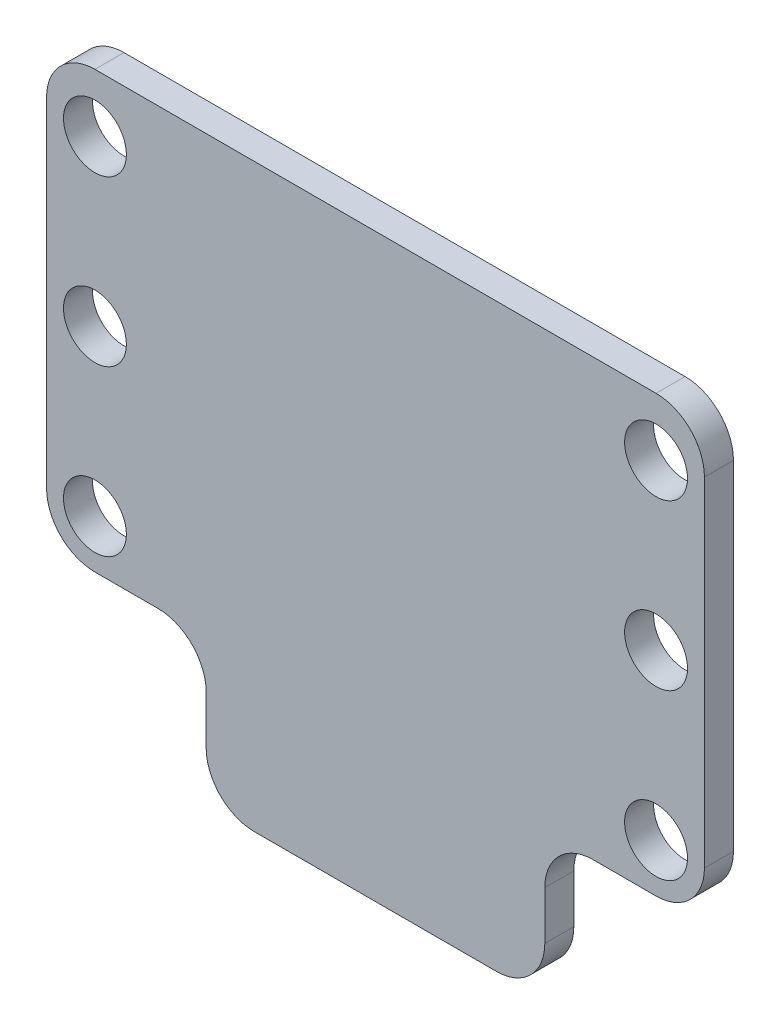
ISO-10303-21;
HEADER;
FILE_DESCRIPTION(('STEP AP214'),'2;1');
FILE_NAME('part.step','',(''),(''),'','','');
FILE_SCHEMA(('AUTOMOTIVE_DESIGN { 1 0 10303 214 1 1 1 1 }'));
ENDSEC;
DATA;
#1=APPLICATION_CONTEXT('core data for automotive mechanical design processes');
#2=APPLICATION_PROTOCOL_DEFINITION('international standard','automotive_design',2000,#1);
#3=PRODUCT_CONTEXT('',#1,'mechanical');
#4=PRODUCT('Part','Part','',(#3));
#5=PRODUCT_RELATED_PRODUCT_CATEGORY('part','',(#4));
#6=PRODUCT_DEFINITION_FORMATION('','',#4);
#7=PRODUCT_DEFINITION_CONTEXT('part definition',#1,'design');
#8=PRODUCT_DEFINITION('design','',#6,#7);
#9=PRODUCT_DEFINITION_SHAPE('','',#8);
#10=(LENGTH_UNIT() NAMED_UNIT(*) SI_UNIT(.MILLI.,.METRE.));
#11=(NAMED_UNIT(*) PLANE_ANGLE_UNIT() SI_UNIT($,.RADIAN.));
#12=(NAMED_UNIT(*) SI_UNIT($,.STERADIAN.) SOLID_ANGLE_UNIT());
#13=UNCERTAINTY_MEASURE_WITH_UNIT(LENGTH_MEASURE(1.E-05),#10,'distance_accuracy_value','');
#14=(GEOMETRIC_REPRESENTATION_CONTEXT(3) GLOBAL_UNCERTAINTY_ASSIGNED_CONTEXT((#13)) GLOBAL_UNIT_ASSIGNED_CONTEXT((#10,
#11,#12)) REPRESENTATION_CONTEXT('',''));
#15=CARTESIAN_POINT('',(0.,0.,0.));
#16=DIRECTION('',(0.,0.,1.));
#17=DIRECTION('',(1.,0.,0.));
#18=AXIS2_PLACEMENT_3D('',#15,#16,#17);
#19=CARTESIAN_POINT('',(0.,0.,3.));
#20=DIRECTION('',(0.,0.,-1.));
#21=DIRECTION('',(-1.,0.,0.));
#22=AXIS2_PLACEMENT_3D('',#19,#20,#21);
#23=PLANE('',#22);
#24=DIRECTION('',(-1.,0.,0.));
#25=VECTOR('',#24,1.);
#26=CARTESIAN_POINT('',(107.208492458902,1.90147341211974,3.));
#27=LINE('',#26,#25);
#28=CARTESIAN_POINT('',(102.208492458902,1.90147341211974,3.));
#29=VERTEX_POINT('',#28);
#30=CARTESIAN_POINT('',(44.2084924589014,1.90147341211974,3.));
#31=VERTEX_POINT('',#30);
#32=EDGE_CURVE('E338',#29,#31,#27,.T.);
#33=ORIENTED_EDGE('',*,*,#32,.T.);
#34=CARTESIAN_POINT('',(44.2084924589014,-3.09852658788026,3.));
#35=DIRECTION('',(0.,0.,-1.));
#36=DIRECTION('',(-1.,0.,0.));
#37=AXIS2_PLACEMENT_3D('',#34,#35,#36);
#38=CIRCLE('',#37,5.);
#39=CARTESIAN_POINT('',(39.2084924589014,-3.09852658788026,3.));
#40=VERTEX_POINT('',#39);
#41=EDGE_CURVE('E246',#31,#40,#38,.F.);
#42=ORIENTED_EDGE('',*,*,#41,.T.);
#43=DIRECTION('',(0.,-1.,0.));
#44=VECTOR('',#43,1.);
#45=CARTESIAN_POINT('',(39.2084924589014,1.90147341211974,3.));
#46=LINE('',#45,#44);
#47=CARTESIAN_POINT('',(39.2084924589014,-38.0985265878802,3.));
#48=VERTEX_POINT('',#47);
#49=EDGE_CURVE('E174',#40,#48,#46,.T.);
#50=ORIENTED_EDGE('',*,*,#49,.T.);
#51=CARTESIAN_POINT('',(44.2084924589014,-38.0985265878803,3.));
#52=DIRECTION('',(0.,0.,-1.));
#53=DIRECTION('',(-1.,0.,0.));
#54=AXIS2_PLACEMENT_3D('',#51,#52,#53);
#55=CIRCLE('',#54,5.);
#56=CARTESIAN_POINT('',(44.2084924589014,-43.0985265878803,3.));
#57=VERTEX_POINT('',#56);
#58=EDGE_CURVE('E243',#48,#57,#55,.F.);
#59=ORIENTED_EDGE('',*,*,#58,.T.);
#60=DIRECTION('',(1.,0.,0.));
#61=VECTOR('',#60,1.);
#62=CARTESIAN_POINT('',(55.7084924589017,-43.0985265878803,3.));
#63=LINE('',#62,#61);
#64=CARTESIAN_POINT('',(50.7084924589017,-43.0985265878803,3.));
#65=VERTEX_POINT('',#64);
#66=EDGE_CURVE('E344',#57,#65,#63,.T.);
#67=ORIENTED_EDGE('',*,*,#66,.T.);
#68=CARTESIAN_POINT('',(50.7084924589017,-48.0985265878803,3.));
#69=DIRECTION('',(0.,0.,-1.));
#70=DIRECTION('',(-1.,0.,0.));
#71=AXIS2_PLACEMENT_3D('',#68,#69,#70);
#72=CIRCLE('',#71,5.);
#73=CARTESIAN_POINT('',(55.7084924589017,-48.0985265878803,3.));
#74=VERTEX_POINT('',#73);
#75=EDGE_CURVE('E293',#65,#74,#72,.T.);
#76=ORIENTED_EDGE('',*,*,#75,.T.);
#77=DIRECTION('',(0.,-1.,0.));
#78=VECTOR('',#77,1.);
#79=CARTESIAN_POINT('',(55.7084924589017,-43.0985265878803,3.));
#80=LINE('',#79,#78);
#81=CARTESIAN_POINT('',(55.7084924589017,-53.0985265878803,3.));
#82=VERTEX_POINT('',#81);
#83=EDGE_CURVE('E348',#74,#82,#80,.T.);
#84=ORIENTED_EDGE('',*,*,#83,.T.);
#85=CARTESIAN_POINT('',(60.7084924589016,-53.0985265878803,3.));
#86=DIRECTION('',(0.,0.,-1.));
#87=DIRECTION('',(-1.,0.,0.));
#88=AXIS2_PLACEMENT_3D('',#85,#86,#87);
#89=CIRCLE('',#88,5.);
#90=CARTESIAN_POINT('',(60.7084924589016,-58.0985265878803,3.));
#91=VERTEX_POINT('',#90);
#92=EDGE_CURVE('E240',#82,#91,#89,.F.);
#93=ORIENTED_EDGE('',*,*,#92,.T.);
#94=DIRECTION('',(1.,0.,0.));
#95=VECTOR('',#94,1.);
#96=CARTESIAN_POINT('',(90.7084924589017,-58.0985265878803,3.));
#97=LINE('',#96,#95);
#98=CARTESIAN_POINT('',(85.7084924589016,-58.0985265878803,3.));
#99=VERTEX_POINT('',#98);
#100=EDGE_CURVE('E312',#91,#99,#97,.T.);
#101=ORIENTED_EDGE('',*,*,#100,.T.);
#102=CARTESIAN_POINT('',(85.7084924589016,-53.0985265878803,3.));
#103=DIRECTION('',(0.,0.,-1.));
#104=DIRECTION('',(-1.,0.,0.));
#105=AXIS2_PLACEMENT_3D('',#102,#103,#104);
#106=CIRCLE('',#105,5.);
#107=CARTESIAN_POINT('',(90.7084924589017,-53.0985265878803,3.));
#108=VERTEX_POINT('',#107);
#109=EDGE_CURVE('E237',#99,#108,#106,.F.);
#110=ORIENTED_EDGE('',*,*,#109,.T.);
#111=DIRECTION('',(0.,1.,0.));
#112=VECTOR('',#111,1.);
#113=CARTESIAN_POINT('',(90.7084924589017,-43.0985265878803,3.));
#114=LINE('',#113,#112);
#115=CARTESIAN_POINT('',(90.7084924589017,-48.0985265878803,3.));
#116=VERTEX_POINT('',#115);
#117=EDGE_CURVE('E309',#108,#116,#114,.T.);
#118=ORIENTED_EDGE('',*,*,#117,.T.);
#119=CARTESIAN_POINT('',(95.7084924589017,-48.0985265878803,3.));
#120=DIRECTION('',(0.,0.,-1.));
#121=DIRECTION('',(-1.,0.,0.));
#122=AXIS2_PLACEMENT_3D('',#119,#120,#121);
#123=CIRCLE('',#122,5.);
#124=CARTESIAN_POINT('',(95.7084924589017,-43.0985265878803,3.));
#125=VERTEX_POINT('',#124);
#126=EDGE_CURVE('E11',#116,#125,#123,.T.);
#127=ORIENTED_EDGE('',*,*,#126,.T.);
#128=DIRECTION('',(1.,0.,0.));
#129=VECTOR('',#128,1.);
#130=CARTESIAN_POINT('',(107.208492458902,-43.0985265878803,3.));
#131=LINE('',#130,#129);
#132=CARTESIAN_POINT('',(102.208492458902,-43.0985265878803,3.));
#133=VERTEX_POINT('',#132);
#134=EDGE_CURVE('E211',#125,#133,#131,.T.);
#135=ORIENTED_EDGE('',*,*,#134,.T.);
#136=CARTESIAN_POINT('',(102.208492458902,-38.0985265878803,3.));
#137=DIRECTION('',(0.,0.,-1.));
#138=DIRECTION('',(-1.,0.,0.));
#139=AXIS2_PLACEMENT_3D('',#136,#137,#138);
#140=CIRCLE('',#139,5.);
#141=CARTESIAN_POINT('',(107.208492458902,-38.0985265878802,3.));
#142=VERTEX_POINT('',#141);
#143=EDGE_CURVE('E234',#133,#142,#140,.F.);
#144=ORIENTED_EDGE('',*,*,#143,.T.);
#145=DIRECTION('',(0.,1.,0.));
#146=VECTOR('',#145,1.);
#147=CARTESIAN_POINT('',(107.208492458902,1.90147341211974,3.));
#148=LINE('',#147,#146);
#149=CARTESIAN_POINT('',(107.208492458902,-3.09852658788026,3.));
#150=VERTEX_POINT('',#149);
#151=EDGE_CURVE('E209',#142,#150,#148,.T.);
#152=ORIENTED_EDGE('',*,*,#151,.T.);
#153=CARTESIAN_POINT('',(102.208492458902,-3.09852658788026,3.));
#154=DIRECTION('',(0.,0.,-1.));
#155=DIRECTION('',(-1.,0.,0.));
#156=AXIS2_PLACEMENT_3D('',#153,#154,#155);
#157=CIRCLE('',#156,5.);
#158=EDGE_CURVE('E231',#150,#29,#157,.F.);
#159=ORIENTED_EDGE('',*,*,#158,.T.);
#160=EDGE_LOOP('',(#33,#42,#50,#59,#67,#76,#84,#93,#101,#110,#118,#127,#135,#144,#152,#159));
#161=FACE_BOUND('',#160,.T.);
#162=CARTESIAN_POINT('',(102.208492458902,-4.09852658788026,3.));
#163=DIRECTION('',(0.,0.,1.));
#164=DIRECTION('',(1.,0.,0.));
#165=AXIS2_PLACEMENT_3D('',#162,#163,#164);
#166=CIRCLE('',#165,3.25000000000001);
#167=CARTESIAN_POINT('',(105.458492458902,-4.09852658788026,3.));
#168=VERTEX_POINT('',#167);
#169=EDGE_CURVE('E317',#168,#168,#166,.T.);
#170=ORIENTED_EDGE('',*,*,#169,.F.);
#171=EDGE_LOOP('',(#170));
#172=FACE_BOUND('',#171,.T.);
#173=CARTESIAN_POINT('',(102.208492458902,-38.0985265878803,3.));
#174=DIRECTION('',(0.,0.,1.));
#175=DIRECTION('',(1.,0.,0.));
#176=AXIS2_PLACEMENT_3D('',#173,#174,#175);
#177=CIRCLE('',#176,3.25000000000001);
#178=CARTESIAN_POINT('',(105.458492458902,-38.0985265878803,3.));
#179=VERTEX_POINT('',#178);
#180=EDGE_CURVE('E329',#179,#179,#177,.T.);
#181=ORIENTED_EDGE('',*,*,#180,.F.);
#182=EDGE_LOOP('',(#181));
#183=FACE_BOUND('',#182,.T.);
#184=CARTESIAN_POINT('',(44.2084924589015,-38.0985265878802,3.));
#185=DIRECTION('',(0.,0.,1.));
#186=DIRECTION('',(1.,0.,0.));
#187=AXIS2_PLACEMENT_3D('',#184,#185,#186);
#188=CIRCLE('',#187,3.25000000000001);
#189=CARTESIAN_POINT('',(47.4584924589015,-38.0985265878802,3.));
#190=VERTEX_POINT('',#189);
#191=EDGE_CURVE('E626',#190,#190,#188,.T.);
#192=ORIENTED_EDGE('',*,*,#191,.F.);
#193=EDGE_LOOP('',(#192));
#194=FACE_BOUND('',#193,.T.);
#195=CARTESIAN_POINT('',(44.2084924589015,-4.09852658788018,3.));
#196=DIRECTION('',(0.,0.,1.));
#197=DIRECTION('',(1.,0.,0.));
#198=AXIS2_PLACEMENT_3D('',#195,#196,#197);
#199=CIRCLE('',#198,3.25);
#200=CARTESIAN_POINT('',(47.4584924589015,-4.09852658788018,3.));
#201=VERTEX_POINT('',#200);
#202=EDGE_CURVE('E618',#201,#201,#199,.T.);
#203=ORIENTED_EDGE('',*,*,#202,.F.);
#204=EDGE_LOOP('',(#203));
#205=FACE_BOUND('',#204,.T.);
#206=CARTESIAN_POINT('',(44.2084924589015,-21.0985265878802,3.));
#207=DIRECTION('',(0.,0.,1.));
#208=DIRECTION('',(1.,0.,0.));
#209=AXIS2_PLACEMENT_3D('',#206,#207,#208);
#210=CIRCLE('',#209,3.25);
#211=CARTESIAN_POINT('',(47.4584924589015,-21.0985265878802,3.));
#212=VERTEX_POINT('',#211);
#213=EDGE_CURVE('E610',#212,#212,#210,.T.);
#214=ORIENTED_EDGE('',*,*,#213,.F.);
#215=EDGE_LOOP('',(#214));
#216=FACE_BOUND('',#215,.T.);
#217=CARTESIAN_POINT('',(102.208492458902,-21.0985265878802,3.));
#218=DIRECTION('',(0.,0.,1.));
#219=DIRECTION('',(1.,0.,0.));
#220=AXIS2_PLACEMENT_3D('',#217,#218,#219);
#221=CIRCLE('',#220,3.25000000000001);
#222=CARTESIAN_POINT('',(105.458492458902,-21.0985265878802,3.));
#223=VERTEX_POINT('',#222);
#224=EDGE_CURVE('E599',#223,#223,#221,.T.);
#225=ORIENTED_EDGE('',*,*,#224,.F.);
#226=EDGE_LOOP('',(#225));
#227=FACE_BOUND('',#226,.T.);
#228=ADVANCED_FACE('F39',(#161,#172,#183,#194,#205,#216,#227),#23,.F.);
#229=CARTESIAN_POINT('',(0.,0.,0.));
#230=DIRECTION('',(0.,0.,-1.));
#231=DIRECTION('',(-1.,0.,0.));
#232=AXIS2_PLACEMENT_3D('',#229,#230,#231);
#233=PLANE('',#232);
#234=CARTESIAN_POINT('',(44.2084924589015,-21.0985265878802,0.));
#235=DIRECTION('',(0.,0.,1.));
#236=DIRECTION('',(1.,0.,0.));
#237=AXIS2_PLACEMENT_3D('',#234,#235,#236);
#238=CIRCLE('',#237,3.25);
#239=CARTESIAN_POINT('',(47.4584924589015,-21.0985265878802,0.));
#240=VERTEX_POINT('',#239);
#241=EDGE_CURVE('E607',#240,#240,#238,.T.);
#242=ORIENTED_EDGE('',*,*,#241,.T.);
#243=EDGE_LOOP('',(#242));
#244=FACE_BOUND('',#243,.T.);
#245=CARTESIAN_POINT('',(44.2084924589015,-38.0985265878802,0.));
#246=DIRECTION('',(0.,0.,1.));
#247=DIRECTION('',(1.,0.,0.));
#248=AXIS2_PLACEMENT_3D('',#245,#246,#247);
#249=CIRCLE('',#248,3.25000000000001);
#250=CARTESIAN_POINT('',(47.4584924589015,-38.0985265878802,0.));
#251=VERTEX_POINT('',#250);
#252=EDGE_CURVE('E622',#251,#251,#249,.T.);
#253=ORIENTED_EDGE('',*,*,#252,.T.);
#254=EDGE_LOOP('',(#253));
#255=FACE_BOUND('',#254,.T.);
#256=CARTESIAN_POINT('',(102.208492458902,-4.09852658788026,0.));
#257=DIRECTION('',(0.,0.,1.));
#258=DIRECTION('',(1.,0.,0.));
#259=AXIS2_PLACEMENT_3D('',#256,#257,#258);
#260=CIRCLE('',#259,3.25000000000001);
#261=CARTESIAN_POINT('',(105.458492458902,-4.09852658788026,0.));
#262=VERTEX_POINT('',#261);
#263=EDGE_CURVE('E323',#262,#262,#260,.T.);
#264=ORIENTED_EDGE('',*,*,#263,.T.);
#265=EDGE_LOOP('',(#264));
#266=FACE_BOUND('',#265,.T.);
#267=DIRECTION('',(0.,-1.,0.));
#268=VECTOR('',#267,1.);
#269=CARTESIAN_POINT('',(39.2084924589014,1.90147341211974,0.));
#270=LINE('',#269,#268);
#271=CARTESIAN_POINT('',(39.2084924589014,-3.09852658788026,0.));
#272=VERTEX_POINT('',#271);
#273=CARTESIAN_POINT('',(39.2084924589014,-38.0985265878802,0.));
#274=VERTEX_POINT('',#273);
#275=EDGE_CURVE('E171',#272,#274,#270,.T.);
#276=ORIENTED_EDGE('',*,*,#275,.F.);
#277=CARTESIAN_POINT('',(44.2084924589014,-3.09852658788026,0.));
#278=DIRECTION('',(0.,0.,-1.));
#279=DIRECTION('',(-1.,0.,0.));
#280=AXIS2_PLACEMENT_3D('',#277,#278,#279);
#281=CIRCLE('',#280,5.);
#282=CARTESIAN_POINT('',(44.2084924589014,1.90147341211974,0.));
#283=VERTEX_POINT('',#282);
#284=EDGE_CURVE('E153',#272,#283,#281,.T.);
#285=ORIENTED_EDGE('',*,*,#284,.T.);
#286=DIRECTION('',(-1.,0.,0.));
#287=VECTOR('',#286,1.);
#288=CARTESIAN_POINT('',(107.208492458902,1.90147341211974,0.));
#289=LINE('',#288,#287);
#290=CARTESIAN_POINT('',(102.208492458902,1.90147341211974,0.));
#291=VERTEX_POINT('',#290);
#292=EDGE_CURVE('E184',#291,#283,#289,.T.);
#293=ORIENTED_EDGE('',*,*,#292,.F.);
#294=CARTESIAN_POINT('',(102.208492458902,-3.09852658788026,0.));
#295=DIRECTION('',(0.,0.,-1.));
#296=DIRECTION('',(-1.,0.,0.));
#297=AXIS2_PLACEMENT_3D('',#294,#295,#296);
#298=CIRCLE('',#297,5.);
#299=CARTESIAN_POINT('',(107.208492458902,-3.09852658788026,0.));
#300=VERTEX_POINT('',#299);
#301=EDGE_CURVE('E176',#291,#300,#298,.T.);
#302=ORIENTED_EDGE('',*,*,#301,.T.);
#303=DIRECTION('',(0.,1.,0.));
#304=VECTOR('',#303,1.);
#305=CARTESIAN_POINT('',(107.208492458902,1.90147341211974,0.));
#306=LINE('',#305,#304);
#307=CARTESIAN_POINT('',(107.208492458902,-38.0985265878802,0.));
#308=VERTEX_POINT('',#307);
#309=EDGE_CURVE('E191',#308,#300,#306,.T.);
#310=ORIENTED_EDGE('',*,*,#309,.F.);
#311=CARTESIAN_POINT('',(102.208492458902,-38.0985265878803,0.));
#312=DIRECTION('',(0.,0.,-1.));
#313=DIRECTION('',(-1.,0.,0.));
#314=AXIS2_PLACEMENT_3D('',#311,#312,#313);
#315=CIRCLE('',#314,5.);
#316=CARTESIAN_POINT('',(102.208492458902,-43.0985265878803,0.));
#317=VERTEX_POINT('',#316);
#318=EDGE_CURVE('E215',#308,#317,#315,.T.);
#319=ORIENTED_EDGE('',*,*,#318,.T.);
#320=DIRECTION('',(1.,0.,0.));
#321=VECTOR('',#320,1.);
#322=CARTESIAN_POINT('',(107.208492458902,-43.0985265878803,0.));
#323=LINE('',#322,#321);
#324=CARTESIAN_POINT('',(95.7084924589017,-43.0985265878803,0.));
#325=VERTEX_POINT('',#324);
#326=EDGE_CURVE('E206',#325,#317,#323,.T.);
#327=ORIENTED_EDGE('',*,*,#326,.F.);
#328=CARTESIAN_POINT('',(95.7084924589017,-48.0985265878803,0.));
#329=DIRECTION('',(0.,0.,-1.));
#330=DIRECTION('',(-1.,0.,0.));
#331=AXIS2_PLACEMENT_3D('',#328,#329,#330);
#332=CIRCLE('',#331,5.);
#333=CARTESIAN_POINT('',(90.7084924589017,-48.0985265878803,0.));
#334=VERTEX_POINT('',#333);
#335=EDGE_CURVE('E48',#325,#334,#332,.F.);
#336=ORIENTED_EDGE('',*,*,#335,.T.);
#337=DIRECTION('',(0.,1.,0.));
#338=VECTOR('',#337,1.);
#339=CARTESIAN_POINT('',(90.7084924589017,-43.0985265878803,0.));
#340=LINE('',#339,#338);
#341=CARTESIAN_POINT('',(90.7084924589017,-53.0985265878803,0.));
#342=VERTEX_POINT('',#341);
#343=EDGE_CURVE('E202',#342,#334,#340,.T.);
#344=ORIENTED_EDGE('',*,*,#343,.F.);
#345=CARTESIAN_POINT('',(85.7084924589016,-53.0985265878803,0.));
#346=DIRECTION('',(0.,0.,-1.));
#347=DIRECTION('',(-1.,0.,0.));
#348=AXIS2_PLACEMENT_3D('',#345,#346,#347);
#349=CIRCLE('',#348,5.);
#350=CARTESIAN_POINT('',(85.7084924589016,-58.0985265878803,0.));
#351=VERTEX_POINT('',#350);
#352=EDGE_CURVE('E218',#342,#351,#349,.T.);
#353=ORIENTED_EDGE('',*,*,#352,.T.);
#354=DIRECTION('',(1.,0.,0.));
#355=VECTOR('',#354,1.);
#356=CARTESIAN_POINT('',(90.7084924589017,-58.0985265878803,0.));
#357=LINE('',#356,#355);
#358=CARTESIAN_POINT('',(60.7084924589016,-58.0985265878803,0.));
#359=VERTEX_POINT('',#358);
#360=EDGE_CURVE('E198',#359,#351,#357,.T.);
#361=ORIENTED_EDGE('',*,*,#360,.F.);
#362=CARTESIAN_POINT('',(60.7084924589016,-53.0985265878803,0.));
#363=DIRECTION('',(0.,0.,-1.));
#364=DIRECTION('',(-1.,0.,0.));
#365=AXIS2_PLACEMENT_3D('',#362,#363,#364);
#366=CIRCLE('',#365,5.);
#367=CARTESIAN_POINT('',(55.7084924589017,-53.0985265878803,0.));
#368=VERTEX_POINT('',#367);
#369=EDGE_CURVE('E221',#359,#368,#366,.T.);
#370=ORIENTED_EDGE('',*,*,#369,.T.);
#371=DIRECTION('',(0.,-1.,0.));
#372=VECTOR('',#371,1.);
#373=CARTESIAN_POINT('',(55.7084924589017,-43.0985265878803,0.));
#374=LINE('',#373,#372);
#375=CARTESIAN_POINT('',(55.7084924589017,-48.0985265878803,0.));
#376=VERTEX_POINT('',#375);
#377=EDGE_CURVE('E189',#376,#368,#374,.T.);
#378=ORIENTED_EDGE('',*,*,#377,.F.);
#379=CARTESIAN_POINT('',(50.7084924589017,-48.0985265878803,0.));
#380=DIRECTION('',(0.,0.,-1.));
#381=DIRECTION('',(-1.,0.,0.));
#382=AXIS2_PLACEMENT_3D('',#379,#380,#381);
#383=CIRCLE('',#382,5.);
#384=CARTESIAN_POINT('',(50.7084924589017,-43.0985265878803,0.));
#385=VERTEX_POINT('',#384);
#386=EDGE_CURVE('E290',#376,#385,#383,.F.);
#387=ORIENTED_EDGE('',*,*,#386,.T.);
#388=DIRECTION('',(1.,0.,0.));
#389=VECTOR('',#388,1.);
#390=CARTESIAN_POINT('',(55.7084924589017,-43.0985265878803,0.));
#391=LINE('',#390,#389);
#392=CARTESIAN_POINT('',(44.2084924589014,-43.0985265878803,0.));
#393=VERTEX_POINT('',#392);
#394=EDGE_CURVE('E183',#393,#385,#391,.T.);
#395=ORIENTED_EDGE('',*,*,#394,.F.);
#396=CARTESIAN_POINT('',(44.2084924589014,-38.0985265878803,0.));
#397=DIRECTION('',(0.,0.,-1.));
#398=DIRECTION('',(-1.,0.,0.));
#399=AXIS2_PLACEMENT_3D('',#396,#397,#398);
#400=CIRCLE('',#399,5.);
#401=EDGE_CURVE('E165',#393,#274,#400,.T.);
#402=ORIENTED_EDGE('',*,*,#401,.T.);
#403=EDGE_LOOP('',(#276,#285,#293,#302,#310,#319,#327,#336,#344,#353,#361,#370,#378,#387,#395,#402));
#404=FACE_BOUND('',#403,.T.);
#405=CARTESIAN_POINT('',(102.208492458902,-38.0985265878803,0.));
#406=DIRECTION('',(0.,0.,1.));
#407=DIRECTION('',(1.,0.,0.));
#408=AXIS2_PLACEMENT_3D('',#405,#406,#407);
#409=CIRCLE('',#408,3.25000000000001);
#410=CARTESIAN_POINT('',(105.458492458902,-38.0985265878803,0.));
#411=VERTEX_POINT('',#410);
#412=EDGE_CURVE('E332',#411,#411,#409,.T.);
#413=ORIENTED_EDGE('',*,*,#412,.T.);
#414=EDGE_LOOP('',(#413));
#415=FACE_BOUND('',#414,.T.);
#416=CARTESIAN_POINT('',(44.2084924589015,-4.09852658788018,0.));
#417=DIRECTION('',(0.,0.,1.));
#418=DIRECTION('',(1.,0.,0.));
#419=AXIS2_PLACEMENT_3D('',#416,#417,#418);
#420=CIRCLE('',#419,3.25);
#421=CARTESIAN_POINT('',(47.4584924589015,-4.09852658788018,0.));
#422=VERTEX_POINT('',#421);
#423=EDGE_CURVE('E614',#422,#422,#420,.T.);
#424=ORIENTED_EDGE('',*,*,#423,.T.);
#425=EDGE_LOOP('',(#424));
#426=FACE_BOUND('',#425,.T.);
#427=CARTESIAN_POINT('',(102.208492458902,-21.0985265878802,0.));
#428=DIRECTION('',(0.,0.,1.));
#429=DIRECTION('',(1.,0.,0.));
#430=AXIS2_PLACEMENT_3D('',#427,#428,#429);
#431=CIRCLE('',#430,3.25000000000001);
#432=CARTESIAN_POINT('',(105.458492458902,-21.0985265878802,0.));
#433=VERTEX_POINT('',#432);
#434=EDGE_CURVE('E602',#433,#433,#431,.T.);
#435=ORIENTED_EDGE('',*,*,#434,.T.);
#436=EDGE_LOOP('',(#435));
#437=FACE_BOUND('',#436,.T.);
#438=ADVANCED_FACE('F179',(#244,#255,#266,#404,#415,#426,#437),#233,.T.);
#439=CARTESIAN_POINT('',(107.208492458902,1.90147341211974,3.));
#440=DIRECTION('',(-1.,0.,0.));
#441=DIRECTION('',(0.,0.,1.));
#442=AXIS2_PLACEMENT_3D('',#439,#440,#441);
#443=PLANE('',#442);
#444=ORIENTED_EDGE('',*,*,#151,.F.);
#445=DIRECTION('',(0.,0.,-1.));
#446=VECTOR('',#445,1.);
#447=CARTESIAN_POINT('',(107.208492458902,-38.0985265878803,3.));
#448=LINE('',#447,#446);
#449=EDGE_CURVE('E286',#142,#308,#448,.T.);
#450=ORIENTED_EDGE('',*,*,#449,.T.);
#451=ORIENTED_EDGE('',*,*,#309,.T.);
#452=DIRECTION('',(0.,0.,-1.));
#453=VECTOR('',#452,1.);
#454=CARTESIAN_POINT('',(107.208492458902,-3.09852658788026,3.));
#455=LINE('',#454,#453);
#456=EDGE_CURVE('E283',#300,#150,#455,.F.);
#457=ORIENTED_EDGE('',*,*,#456,.T.);
#458=EDGE_LOOP('',(#444,#450,#451,#457));
#459=FACE_BOUND('',#458,.T.);
#460=ADVANCED_FACE('F393',(#459),#443,.F.);
#461=CARTESIAN_POINT('',(107.208492458902,1.90147341211974,3.));
#462=DIRECTION('',(0.,-1.,0.));
#463=DIRECTION('',(0.,0.,-1.));
#464=AXIS2_PLACEMENT_3D('',#461,#462,#463);
#465=PLANE('',#464);
#466=ORIENTED_EDGE('',*,*,#292,.T.);
#467=DIRECTION('',(0.,0.,-1.));
#468=VECTOR('',#467,1.);
#469=CARTESIAN_POINT('',(44.2084924589014,1.90147341211974,3.));
#470=LINE('',#469,#468);
#471=EDGE_CURVE('E158',#283,#31,#470,.F.);
#472=ORIENTED_EDGE('',*,*,#471,.T.);
#473=ORIENTED_EDGE('',*,*,#32,.F.);
#474=DIRECTION('',(0.,0.,-1.));
#475=VECTOR('',#474,1.);
#476=CARTESIAN_POINT('',(102.208492458902,1.90147341211974,3.));
#477=LINE('',#476,#475);
#478=EDGE_CURVE('E164',#29,#291,#477,.T.);
#479=ORIENTED_EDGE('',*,*,#478,.T.);
#480=EDGE_LOOP('',(#466,#472,#473,#479));
#481=FACE_BOUND('',#480,.T.);
#482=ADVANCED_FACE('F387',(#481),#465,.F.);
#483=CARTESIAN_POINT('',(39.2084924589014,1.90147341211974,3.));
#484=DIRECTION('',(1.,0.,0.));
#485=DIRECTION('',(0.,0.,-1.));
#486=AXIS2_PLACEMENT_3D('',#483,#484,#485);
#487=PLANE('',#486);
#488=ORIENTED_EDGE('',*,*,#49,.F.);
#489=DIRECTION('',(0.,0.,-1.));
#490=VECTOR('',#489,1.);
#491=CARTESIAN_POINT('',(39.2084924589014,-3.09852658788026,3.));
#492=LINE('',#491,#490);
#493=EDGE_CURVE('E157',#40,#272,#492,.T.);
#494=ORIENTED_EDGE('',*,*,#493,.T.);
#495=ORIENTED_EDGE('',*,*,#275,.T.);
#496=DIRECTION('',(0.,0.,-1.));
#497=VECTOR('',#496,1.);
#498=CARTESIAN_POINT('',(39.2084924589014,-38.0985265878803,3.));
#499=LINE('',#498,#497);
#500=EDGE_CURVE('E177',#274,#48,#499,.F.);
#501=ORIENTED_EDGE('',*,*,#500,.T.);
#502=EDGE_LOOP('',(#488,#494,#495,#501));
#503=FACE_BOUND('',#502,.T.);
#504=ADVANCED_FACE('F170',(#503),#487,.F.);
#505=CARTESIAN_POINT('',(55.7084924589017,-43.0985265878803,3.));
#506=DIRECTION('',(0.,1.,0.));
#507=DIRECTION('',(0.,0.,1.));
#508=AXIS2_PLACEMENT_3D('',#505,#506,#507);
#509=PLANE('',#508);
#510=ORIENTED_EDGE('',*,*,#66,.F.);
#511=DIRECTION('',(0.,0.,-1.));
#512=VECTOR('',#511,1.);
#513=CARTESIAN_POINT('',(44.2084924589014,-43.0985265878803,3.));
#514=LINE('',#513,#512);
#515=EDGE_CURVE('E252',#57,#393,#514,.T.);
#516=ORIENTED_EDGE('',*,*,#515,.T.);
#517=ORIENTED_EDGE('',*,*,#394,.T.);
#518=DIRECTION('',(0.,0.,-1.));
#519=VECTOR('',#518,1.);
#520=CARTESIAN_POINT('',(50.7084924589017,-43.0985265878803,3.));
#521=LINE('',#520,#519);
#522=EDGE_CURVE('E249',#385,#65,#521,.F.);
#523=ORIENTED_EDGE('',*,*,#522,.T.);
#524=EDGE_LOOP('',(#510,#516,#517,#523));
#525=FACE_BOUND('',#524,.T.);
#526=ADVANCED_FACE('F378',(#525),#509,.F.);
#527=CARTESIAN_POINT('',(55.7084924589017,-43.0985265878803,3.));
#528=DIRECTION('',(1.,0.,0.));
#529=DIRECTION('',(0.,0.,-1.));
#530=AXIS2_PLACEMENT_3D('',#527,#528,#529);
#531=PLANE('',#530);
#532=ORIENTED_EDGE('',*,*,#377,.T.);
#533=DIRECTION('',(0.,0.,-1.));
#534=VECTOR('',#533,1.);
#535=CARTESIAN_POINT('',(55.7084924589017,-53.0985265878803,3.));
#536=LINE('',#535,#534);
#537=EDGE_CURVE('E267',#368,#82,#536,.F.);
#538=ORIENTED_EDGE('',*,*,#537,.T.);
#539=ORIENTED_EDGE('',*,*,#83,.F.);
#540=DIRECTION('',(0.,0.,-1.));
#541=VECTOR('',#540,1.);
#542=CARTESIAN_POINT('',(55.7084924589017,-48.0985265878803,0.));
#543=LINE('',#542,#541);
#544=EDGE_CURVE('E263',#74,#376,#543,.T.);
#545=ORIENTED_EDGE('',*,*,#544,.T.);
#546=EDGE_LOOP('',(#532,#538,#539,#545));
#547=FACE_BOUND('',#546,.T.);
#548=ADVANCED_FACE('F369',(#547),#531,.F.);
#549=CARTESIAN_POINT('',(90.7084924589017,-58.0985265878803,3.));
#550=DIRECTION('',(0.,1.,0.));
#551=DIRECTION('',(0.,0.,1.));
#552=AXIS2_PLACEMENT_3D('',#549,#550,#551);
#553=PLANE('',#552);
#554=ORIENTED_EDGE('',*,*,#100,.F.);
#555=DIRECTION('',(0.,0.,-1.));
#556=VECTOR('',#555,1.);
#557=CARTESIAN_POINT('',(60.7084924589016,-58.0985265878803,3.));
#558=LINE('',#557,#556);
#559=EDGE_CURVE('E259',#91,#359,#558,.T.);
#560=ORIENTED_EDGE('',*,*,#559,.T.);
#561=ORIENTED_EDGE('',*,*,#360,.T.);
#562=DIRECTION('',(0.,0.,-1.));
#563=VECTOR('',#562,1.);
#564=CARTESIAN_POINT('',(85.7084924589016,-58.0985265878803,3.));
#565=LINE('',#564,#563);
#566=EDGE_CURVE('E256',#351,#99,#565,.F.);
#567=ORIENTED_EDGE('',*,*,#566,.T.);
#568=EDGE_LOOP('',(#554,#560,#561,#567));
#569=FACE_BOUND('',#568,.T.);
#570=ADVANCED_FACE('F363',(#569),#553,.F.);
#571=CARTESIAN_POINT('',(90.7084924589017,-43.0985265878803,3.));
#572=DIRECTION('',(-1.,0.,0.));
#573=DIRECTION('',(0.,0.,1.));
#574=AXIS2_PLACEMENT_3D('',#571,#572,#573);
#575=PLANE('',#574);
#576=ORIENTED_EDGE('',*,*,#117,.F.);
#577=DIRECTION('',(0.,0.,-1.));
#578=VECTOR('',#577,1.);
#579=CARTESIAN_POINT('',(90.7084924589017,-53.0985265878803,3.));
#580=LINE('',#579,#578);
#581=EDGE_CURVE('E273',#108,#342,#580,.T.);
#582=ORIENTED_EDGE('',*,*,#581,.T.);
#583=ORIENTED_EDGE('',*,*,#343,.T.);
#584=DIRECTION('',(0.,0.,-1.));
#585=VECTOR('',#584,1.);
#586=CARTESIAN_POINT('',(90.7084924589017,-48.0985265878803,3.));
#587=LINE('',#586,#585);
#588=EDGE_CURVE('E270',#334,#116,#587,.F.);
#589=ORIENTED_EDGE('',*,*,#588,.T.);
#590=EDGE_LOOP('',(#576,#582,#583,#589));
#591=FACE_BOUND('',#590,.T.);
#592=ADVANCED_FACE('F303',(#591),#575,.F.);
#593=CARTESIAN_POINT('',(107.208492458902,-43.0985265878803,3.));
#594=DIRECTION('',(0.,1.,0.));
#595=DIRECTION('',(0.,0.,1.));
#596=AXIS2_PLACEMENT_3D('',#593,#594,#595);
#597=PLANE('',#596);
#598=ORIENTED_EDGE('',*,*,#134,.F.);
#599=DIRECTION('',(0.,0.,-1.));
#600=VECTOR('',#599,1.);
#601=CARTESIAN_POINT('',(95.7084924589017,-43.0985265878803,0.));
#602=LINE('',#601,#600);
#603=EDGE_CURVE('E279',#125,#325,#602,.T.);
#604=ORIENTED_EDGE('',*,*,#603,.T.);
#605=ORIENTED_EDGE('',*,*,#326,.T.);
#606=DIRECTION('',(0.,0.,-1.));
#607=VECTOR('',#606,1.);
#608=CARTESIAN_POINT('',(102.208492458902,-43.0985265878803,3.));
#609=LINE('',#608,#607);
#610=EDGE_CURVE('E55',#317,#133,#609,.F.);
#611=ORIENTED_EDGE('',*,*,#610,.T.);
#612=EDGE_LOOP('',(#598,#604,#605,#611));
#613=FACE_BOUND('',#612,.T.);
#614=ADVANCED_FACE('F306',(#613),#597,.F.);
#615=CARTESIAN_POINT('',(102.208492458902,-4.09852658788026,3.));
#616=DIRECTION('',(0.,0.,-1.));
#617=DIRECTION('',(-1.,0.,0.));
#618=AXIS2_PLACEMENT_3D('',#615,#616,#617);
#619=CYLINDRICAL_SURFACE('',#618,3.25000000000001);
#620=ORIENTED_EDGE('',*,*,#169,.T.);
#621=EDGE_LOOP('',(#620));
#622=FACE_BOUND('',#621,.T.);
#623=ORIENTED_EDGE('',*,*,#263,.F.);
#624=EDGE_LOOP('',(#623));
#625=FACE_BOUND('',#624,.T.);
#626=ADVANCED_FACE('F409',(#622,#625),#619,.F.);
#627=CARTESIAN_POINT('',(102.208492458902,-38.0985265878803,3.));
#628=DIRECTION('',(0.,0.,-1.));
#629=DIRECTION('',(-1.,0.,0.));
#630=AXIS2_PLACEMENT_3D('',#627,#628,#629);
#631=CYLINDRICAL_SURFACE('',#630,3.25000000000001);
#632=ORIENTED_EDGE('',*,*,#180,.T.);
#633=EDGE_LOOP('',(#632));
#634=FACE_BOUND('',#633,.T.);
#635=ORIENTED_EDGE('',*,*,#412,.F.);
#636=EDGE_LOOP('',(#635));
#637=FACE_BOUND('',#636,.T.);
#638=ADVANCED_FACE('F454',(#634,#637),#631,.F.);
#639=CARTESIAN_POINT('',(44.2084924589015,-38.0985265878802,3.));
#640=DIRECTION('',(0.,0.,-1.));
#641=DIRECTION('',(-1.,0.,0.));
#642=AXIS2_PLACEMENT_3D('',#639,#640,#641);
#643=CYLINDRICAL_SURFACE('',#642,3.25000000000001);
#644=ORIENTED_EDGE('',*,*,#191,.T.);
#645=EDGE_LOOP('',(#644));
#646=FACE_BOUND('',#645,.T.);
#647=ORIENTED_EDGE('',*,*,#252,.F.);
#648=EDGE_LOOP('',(#647));
#649=FACE_BOUND('',#648,.T.);
#650=ADVANCED_FACE('F460',(#646,#649),#643,.F.);
#651=CARTESIAN_POINT('',(44.2084924589015,-4.09852658788018,3.));
#652=DIRECTION('',(0.,0.,-1.));
#653=DIRECTION('',(-1.,0.,0.));
#654=AXIS2_PLACEMENT_3D('',#651,#652,#653);
#655=CYLINDRICAL_SURFACE('',#654,3.25);
#656=ORIENTED_EDGE('',*,*,#202,.T.);
#657=EDGE_LOOP('',(#656));
#658=FACE_BOUND('',#657,.T.);
#659=ORIENTED_EDGE('',*,*,#423,.F.);
#660=EDGE_LOOP('',(#659));
#661=FACE_BOUND('',#660,.T.);
#662=ADVANCED_FACE('F467',(#658,#661),#655,.F.);
#663=CARTESIAN_POINT('',(44.2084924589015,-21.0985265878802,3.));
#664=DIRECTION('',(0.,0.,-1.));
#665=DIRECTION('',(-1.,0.,0.));
#666=AXIS2_PLACEMENT_3D('',#663,#664,#665);
#667=CYLINDRICAL_SURFACE('',#666,3.25);
#668=ORIENTED_EDGE('',*,*,#213,.T.);
#669=EDGE_LOOP('',(#668));
#670=FACE_BOUND('',#669,.T.);
#671=ORIENTED_EDGE('',*,*,#241,.F.);
#672=EDGE_LOOP('',(#671));
#673=FACE_BOUND('',#672,.T.);
#674=ADVANCED_FACE('F475',(#670,#673),#667,.F.);
#675=CARTESIAN_POINT('',(102.208492458902,-21.0985265878802,3.));
#676=DIRECTION('',(0.,0.,-1.));
#677=DIRECTION('',(-1.,0.,0.));
#678=AXIS2_PLACEMENT_3D('',#675,#676,#677);
#679=CYLINDRICAL_SURFACE('',#678,3.25000000000001);
#680=ORIENTED_EDGE('',*,*,#224,.T.);
#681=EDGE_LOOP('',(#680));
#682=FACE_BOUND('',#681,.T.);
#683=ORIENTED_EDGE('',*,*,#434,.F.);
#684=EDGE_LOOP('',(#683));
#685=FACE_BOUND('',#684,.T.);
#686=ADVANCED_FACE('F483',(#682,#685),#679,.F.);
#687=CARTESIAN_POINT('',(44.2084924589014,-3.09852658788026,3.));
#688=DIRECTION('',(0.,0.,-1.));
#689=DIRECTION('',(-1.,0.,0.));
#690=AXIS2_PLACEMENT_3D('',#687,#688,#689);
#691=CYLINDRICAL_SURFACE('',#690,5.);
#692=ORIENTED_EDGE('',*,*,#41,.F.);
#693=ORIENTED_EDGE('',*,*,#471,.F.);
#694=ORIENTED_EDGE('',*,*,#284,.F.);
#695=ORIENTED_EDGE('',*,*,#493,.F.);
#696=EDGE_LOOP('',(#692,#693,#694,#695));
#697=FACE_BOUND('',#696,.T.);
#698=ADVANCED_FACE('F156',(#697),#691,.T.);
#699=CARTESIAN_POINT('',(44.2084924589014,-38.0985265878803,3.));
#700=DIRECTION('',(0.,0.,-1.));
#701=DIRECTION('',(-1.,0.,0.));
#702=AXIS2_PLACEMENT_3D('',#699,#700,#701);
#703=CYLINDRICAL_SURFACE('',#702,5.);
#704=ORIENTED_EDGE('',*,*,#58,.F.);
#705=ORIENTED_EDGE('',*,*,#500,.F.);
#706=ORIENTED_EDGE('',*,*,#401,.F.);
#707=ORIENTED_EDGE('',*,*,#515,.F.);
#708=EDGE_LOOP('',(#704,#705,#706,#707));
#709=FACE_BOUND('',#708,.T.);
#710=ADVANCED_FACE('F382',(#709),#703,.T.);
#711=CARTESIAN_POINT('',(60.7084924589016,-53.0985265878803,3.));
#712=DIRECTION('',(0.,0.,-1.));
#713=DIRECTION('',(-1.,0.,0.));
#714=AXIS2_PLACEMENT_3D('',#711,#712,#713);
#715=CYLINDRICAL_SURFACE('',#714,5.);
#716=ORIENTED_EDGE('',*,*,#92,.F.);
#717=ORIENTED_EDGE('',*,*,#537,.F.);
#718=ORIENTED_EDGE('',*,*,#369,.F.);
#719=ORIENTED_EDGE('',*,*,#559,.F.);
#720=EDGE_LOOP('',(#716,#717,#718,#719));
#721=FACE_BOUND('',#720,.T.);
#722=ADVANCED_FACE('F365',(#721),#715,.T.);
#723=CARTESIAN_POINT('',(50.7084924589017,-48.0985265878803,3.));
#724=DIRECTION('',(0.,0.,1.));
#725=DIRECTION('',(1.,0.,0.));
#726=AXIS2_PLACEMENT_3D('',#723,#724,#725);
#727=CYLINDRICAL_SURFACE('',#726,5.);
#728=ORIENTED_EDGE('',*,*,#75,.F.);
#729=ORIENTED_EDGE('',*,*,#522,.F.);
#730=ORIENTED_EDGE('',*,*,#386,.F.);
#731=ORIENTED_EDGE('',*,*,#544,.F.);
#732=EDGE_LOOP('',(#728,#729,#730,#731));
#733=FACE_BOUND('',#732,.T.);
#734=ADVANCED_FACE('F374',(#733),#727,.F.);
#735=CARTESIAN_POINT('',(85.7084924589016,-53.0985265878803,3.));
#736=DIRECTION('',(0.,0.,-1.));
#737=DIRECTION('',(-1.,0.,0.));
#738=AXIS2_PLACEMENT_3D('',#735,#736,#737);
#739=CYLINDRICAL_SURFACE('',#738,5.);
#740=ORIENTED_EDGE('',*,*,#109,.F.);
#741=ORIENTED_EDGE('',*,*,#566,.F.);
#742=ORIENTED_EDGE('',*,*,#352,.F.);
#743=ORIENTED_EDGE('',*,*,#581,.F.);
#744=EDGE_LOOP('',(#740,#741,#742,#743));
#745=FACE_BOUND('',#744,.T.);
#746=ADVANCED_FACE('F361',(#745),#739,.T.);
#747=CARTESIAN_POINT('',(95.7084924589017,-48.0985265878803,3.));
#748=DIRECTION('',(0.,0.,1.));
#749=DIRECTION('',(1.,0.,0.));
#750=AXIS2_PLACEMENT_3D('',#747,#748,#749);
#751=CYLINDRICAL_SURFACE('',#750,5.);
#752=ORIENTED_EDGE('',*,*,#126,.F.);
#753=ORIENTED_EDGE('',*,*,#588,.F.);
#754=ORIENTED_EDGE('',*,*,#335,.F.);
#755=ORIENTED_EDGE('',*,*,#603,.F.);
#756=EDGE_LOOP('',(#752,#753,#754,#755));
#757=FACE_BOUND('',#756,.T.);
#758=ADVANCED_FACE('F305',(#757),#751,.F.);
#759=CARTESIAN_POINT('',(102.208492458902,-38.0985265878803,3.));
#760=DIRECTION('',(0.,0.,-1.));
#761=DIRECTION('',(-1.,0.,0.));
#762=AXIS2_PLACEMENT_3D('',#759,#760,#761);
#763=CYLINDRICAL_SURFACE('',#762,5.);
#764=ORIENTED_EDGE('',*,*,#143,.F.);
#765=ORIENTED_EDGE('',*,*,#610,.F.);
#766=ORIENTED_EDGE('',*,*,#318,.F.);
#767=ORIENTED_EDGE('',*,*,#449,.F.);
#768=EDGE_LOOP('',(#764,#765,#766,#767));
#769=FACE_BOUND('',#768,.T.);
#770=ADVANCED_FACE('F391',(#769),#763,.T.);
#771=CARTESIAN_POINT('',(102.208492458902,-3.09852658788026,3.));
#772=DIRECTION('',(0.,0.,-1.));
#773=DIRECTION('',(-1.,0.,0.));
#774=AXIS2_PLACEMENT_3D('',#771,#772,#773);
#775=CYLINDRICAL_SURFACE('',#774,5.);
#776=ORIENTED_EDGE('',*,*,#158,.F.);
#777=ORIENTED_EDGE('',*,*,#456,.F.);
#778=ORIENTED_EDGE('',*,*,#301,.F.);
#779=ORIENTED_EDGE('',*,*,#478,.F.);
#780=EDGE_LOOP('',(#776,#777,#778,#779));
#781=FACE_BOUND('',#780,.T.);
#782=ADVANCED_FACE('F41',(#781),#775,.T.);
#783=CLOSED_SHELL('',(#228,#438,#460,#482,#504,#526,#548,#570,#592,#614,#626,#638,#650,#662,
#674,#686,#698,#710,#722,#734,#746,#758,#770,#782));
#784=MANIFOLD_SOLID_BREP('B2',#783);
#785=ADVANCED_BREP_SHAPE_REPRESENTATION('',(#18,#784),#14);
#786=SHAPE_DEFINITION_REPRESENTATION(#9,#785);
ENDSEC;
END-ISO-10303-21;
